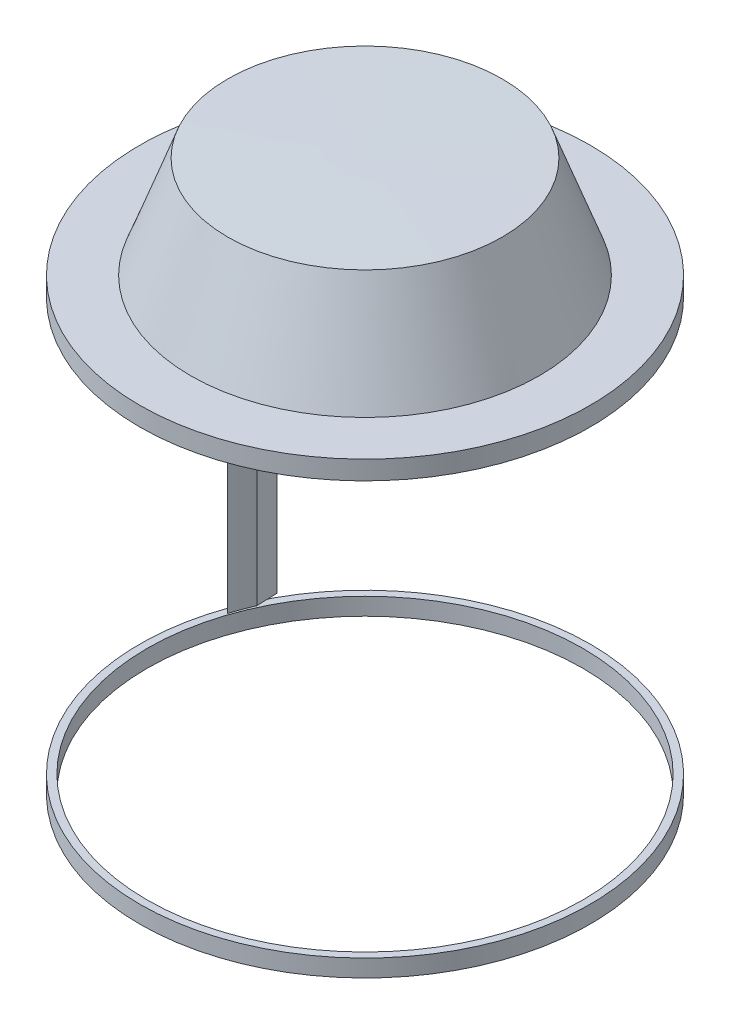
ISO-10303-21;
HEADER;
FILE_DESCRIPTION(('STEP AP214'),'2;1');
FILE_NAME('part.step','',(''),(''),'','','');
FILE_SCHEMA(('AUTOMOTIVE_DESIGN { 1 0 10303 214 1 1 1 1 }'));
ENDSEC;
DATA;
#1=APPLICATION_CONTEXT('core data for automotive mechanical design processes');
#2=APPLICATION_PROTOCOL_DEFINITION('international standard','automotive_design',2000,#1);
#3=PRODUCT_CONTEXT('',#1,'mechanical');
#4=PRODUCT('Part','Part','',(#3));
#5=PRODUCT_RELATED_PRODUCT_CATEGORY('part','',(#4));
#6=PRODUCT_DEFINITION_FORMATION('','',#4);
#7=PRODUCT_DEFINITION_CONTEXT('part definition',#1,'design');
#8=PRODUCT_DEFINITION('design','',#6,#7);
#9=PRODUCT_DEFINITION_SHAPE('','',#8);
#10=(LENGTH_UNIT() NAMED_UNIT(*) SI_UNIT(.MILLI.,.METRE.));
#11=(NAMED_UNIT(*) PLANE_ANGLE_UNIT() SI_UNIT($,.RADIAN.));
#12=(NAMED_UNIT(*) SI_UNIT($,.STERADIAN.) SOLID_ANGLE_UNIT());
#13=UNCERTAINTY_MEASURE_WITH_UNIT(LENGTH_MEASURE(1.E-05),#10,'distance_accuracy_value','');
#14=(GEOMETRIC_REPRESENTATION_CONTEXT(3) GLOBAL_UNCERTAINTY_ASSIGNED_CONTEXT((#13)) GLOBAL_UNIT_ASSIGNED_CONTEXT((#10,
#11,#12)) REPRESENTATION_CONTEXT('',''));
#15=CARTESIAN_POINT('',(0.,0.,0.));
#16=DIRECTION('',(0.,0.,1.));
#17=DIRECTION('',(1.,0.,0.));
#18=AXIS2_PLACEMENT_3D('',#15,#16,#17);
#19=CARTESIAN_POINT('',(50.8214618660544,38.8006335245978,0.));
#20=DIRECTION('',(0.,-1.,0.));
#21=DIRECTION('',(0.,0.,-1.));
#22=AXIS2_PLACEMENT_3D('',#19,#20,#21);
#23=PLANE('',#22);
#24=CARTESIAN_POINT('',(0.,38.8006335245978,0.));
#25=DIRECTION('',(0.,1.,0.));
#26=DIRECTION('',(0.,0.,1.));
#27=AXIS2_PLACEMENT_3D('',#24,#25,#26);
#28=CIRCLE('',#27,39.3096573372102);
#29=CARTESIAN_POINT('',(0.,38.8006335245978,39.3096573372102));
#30=VERTEX_POINT('',#29);
#31=EDGE_CURVE('E53',#30,#30,#28,.T.);
#32=ORIENTED_EDGE('',*,*,#31,.F.);
#33=EDGE_LOOP('',(#32));
#34=FACE_BOUND('',#33,.T.);
#35=CARTESIAN_POINT('',(0.,38.8006335245978,0.));
#36=DIRECTION('',(0.,1.,0.));
#37=DIRECTION('',(0.,0.,1.));
#38=AXIS2_PLACEMENT_3D('',#35,#36,#37);
#39=CIRCLE('',#38,50.8214618660544);
#40=CARTESIAN_POINT('',(0.,38.8006335245978,50.8214618660544));
#41=VERTEX_POINT('',#40);
#42=EDGE_CURVE('E86',#41,#41,#39,.T.);
#43=ORIENTED_EDGE('',*,*,#42,.T.);
#44=EDGE_LOOP('',(#43));
#45=FACE_BOUND('',#44,.T.);
#46=ADVANCED_FACE('F46',(#34,#45),#23,.F.);
#47=CARTESIAN_POINT('',(46.9224710295217,34.547188975653,0.));
#48=DIRECTION('',(0.,1.,0.));
#49=DIRECTION('',(0.,0.,1.));
#50=AXIS2_PLACEMENT_3D('',#47,#48,#49);
#51=PLANE('',#50);
#52=CARTESIAN_POINT('',(0.,34.547188975653,0.));
#53=DIRECTION('',(0.,1.,0.));
#54=DIRECTION('',(0.,0.,1.));
#55=AXIS2_PLACEMENT_3D('',#52,#53,#54);
#56=CIRCLE('',#55,49.1542674276819);
#57=CARTESIAN_POINT('',(0.,34.547188975653,49.1542674276819));
#58=VERTEX_POINT('',#57);
#59=EDGE_CURVE('E87',#58,#58,#56,.T.);
#60=ORIENTED_EDGE('',*,*,#59,.T.);
#61=EDGE_LOOP('',(#60));
#62=FACE_BOUND('',#61,.T.);
#63=CARTESIAN_POINT('',(0.,34.547188975653,0.));
#64=DIRECTION('',(0.,1.,0.));
#65=DIRECTION('',(0.,0.,1.));
#66=AXIS2_PLACEMENT_3D('',#63,#64,#65);
#67=CIRCLE('',#66,50.8214618660544);
#68=CARTESIAN_POINT('',(0.,34.547188975653,50.8214618660544));
#69=VERTEX_POINT('',#68);
#70=EDGE_CURVE('E90',#69,#69,#67,.T.);
#71=ORIENTED_EDGE('',*,*,#70,.F.);
#72=EDGE_LOOP('',(#71));
#73=FACE_BOUND('',#72,.T.);
#74=ADVANCED_FACE('F69',(#62,#73),#51,.F.);
#75=CARTESIAN_POINT('',(0.,38.8006335245978,0.));
#76=DIRECTION('',(0.,1.,0.));
#77=DIRECTION('',(0.,0.,1.));
#78=AXIS2_PLACEMENT_3D('',#75,#76,#77);
#79=CYLINDRICAL_SURFACE('',#78,50.8214618660544);
#80=ORIENTED_EDGE('',*,*,#42,.F.);
#81=EDGE_LOOP('',(#80));
#82=FACE_BOUND('',#81,.T.);
#83=ORIENTED_EDGE('',*,*,#70,.T.);
#84=EDGE_LOOP('',(#83));
#85=FACE_BOUND('',#84,.T.);
#86=ADVANCED_FACE('F59',(#82,#85),#79,.T.);
#87=CARTESIAN_POINT('',(0.,61.9732628137815,0.));
#88=DIRECTION('',(0.,-1.,0.));
#89=DIRECTION('',(0.,0.,-1.));
#90=AXIS2_PLACEMENT_3D('',#87,#88,#89);
#91=CONICAL_SURFACE('',#90,0.,1.56220719829463);
#92=CARTESIAN_POINT('',(0.,61.7075018877193,0.));
#93=DIRECTION('',(0.,1.,0.));
#94=DIRECTION('',(0.,0.,1.));
#95=AXIS2_PLACEMENT_3D('',#92,#93,#94);
#96=CIRCLE('',#95,30.9407864469088);
#97=CARTESIAN_POINT('',(0.,61.7075018877193,30.9407864469088));
#98=VERTEX_POINT('',#97);
#99=EDGE_CURVE('E94',#98,#98,#96,.T.);
#100=ORIENTED_EDGE('',*,*,#99,.T.);
#101=EDGE_LOOP('',(#100));
#102=FACE_BOUND('',#101,.T.);
#103=CARTESIAN_POINT('',(0.,61.9732628137815,0.));
#104=VERTEX_POINT('',#103);
#105=VERTEX_LOOP('',#104);
#106=FACE_BOUND('',#105,.T.);
#107=ADVANCED_FACE('F56',(#102,#106),#91,.T.);
#108=CARTESIAN_POINT('',(0.,61.7075018877193,0.));
#109=DIRECTION('',(0.,-1.,0.));
#110=DIRECTION('',(0.,0.,-1.));
#111=AXIS2_PLACEMENT_3D('',#108,#109,#110);
#112=CONICAL_SURFACE('',#111,30.9407864469088,0.350277762928811);
#113=ORIENTED_EDGE('',*,*,#31,.T.);
#114=EDGE_LOOP('',(#113));
#115=FACE_BOUND('',#114,.T.);
#116=ORIENTED_EDGE('',*,*,#99,.F.);
#117=EDGE_LOOP('',(#116));
#118=FACE_BOUND('',#117,.T.);
#119=ADVANCED_FACE('F58',(#115,#118),#112,.T.);
#120=CARTESIAN_POINT('',(0.,35.4268717747467,0.));
#121=DIRECTION('',(0.,-1.,0.));
#122=DIRECTION('',(0.,0.,-1.));
#123=AXIS2_PLACEMENT_3D('',#120,#121,#122);
#124=PLANE('',#123);
#125=CARTESIAN_POINT('',(0.,35.4268717747467,0.));
#126=DIRECTION('',(0.,-1.,0.));
#127=DIRECTION('',(0.,0.,-1.));
#128=AXIS2_PLACEMENT_3D('',#125,#126,#127);
#129=CIRCLE('',#128,49.1542674276819);
#130=CARTESIAN_POINT('',(0.,35.4268717747467,-49.1542674276819));
#131=VERTEX_POINT('',#130);
#132=EDGE_CURVE('E12',#131,#131,#129,.T.);
#133=ORIENTED_EDGE('',*,*,#132,.T.);
#134=EDGE_LOOP('',(#133));
#135=FACE_BOUND('',#134,.T.);
#136=ADVANCED_FACE('F66',(#135),#124,.T.);
#137=CARTESIAN_POINT('',(0.,35.4268717747467,0.));
#138=DIRECTION('',(0.,-1.,0.));
#139=DIRECTION('',(0.,0.,-1.));
#140=AXIS2_PLACEMENT_3D('',#137,#138,#139);
#141=CYLINDRICAL_SURFACE('',#140,49.1542674276819);
#142=ORIENTED_EDGE('',*,*,#132,.F.);
#143=EDGE_LOOP('',(#142));
#144=FACE_BOUND('',#143,.T.);
#145=ORIENTED_EDGE('',*,*,#59,.F.);
#146=EDGE_LOOP('',(#145));
#147=FACE_BOUND('',#146,.T.);
#148=ADVANCED_FACE('F48',(#144,#147),#141,.F.);
#149=CLOSED_SHELL('',(#46,#74,#86,#107,#119,#136,#148));
#150=MANIFOLD_SOLID_BREP('B2',#149);
#151=CARTESIAN_POINT('',(0.,0.,-25.));
#152=DIRECTION('',(0.,0.,1.));
#153=DIRECTION('',(1.,0.,0.));
#154=AXIS2_PLACEMENT_3D('',#151,#152,#153);
#155=PLANE('',#154);
#156=DIRECTION('',(0.,-1.,0.));
#157=VECTOR('',#156,1.);
#158=CARTESIAN_POINT('',(-46.4604895548918,0.,-25.));
#159=LINE('',#158,#157);
#160=CARTESIAN_POINT('',(-46.4604895548918,34.0899547844391,-25.));
#161=VERTEX_POINT('',#160);
#162=CARTESIAN_POINT('',(-46.4604895548918,-58.2377607655151,-25.));
#163=VERTEX_POINT('',#162);
#164=EDGE_CURVE('E222',#161,#163,#159,.T.);
#165=ORIENTED_EDGE('',*,*,#164,.F.);
#166=DIRECTION('',(-1.,0.,0.));
#167=VECTOR('',#166,1.);
#168=CARTESIAN_POINT('',(0.,34.0899547844391,-25.));
#169=LINE('',#168,#167);
#170=CARTESIAN_POINT('',(-44.8332428013027,34.0899547844391,-25.));
#171=VERTEX_POINT('',#170);
#172=EDGE_CURVE('E232',#171,#161,#169,.T.);
#173=ORIENTED_EDGE('',*,*,#172,.F.);
#174=DIRECTION('',(0.,1.,0.));
#175=VECTOR('',#174,1.);
#176=CARTESIAN_POINT('',(-44.8332428013026,0.,-25.));
#177=LINE('',#176,#175);
#178=CARTESIAN_POINT('',(-44.8332428013026,-58.2377607655151,-25.));
#179=VERTEX_POINT('',#178);
#180=EDGE_CURVE('E239',#179,#171,#177,.T.);
#181=ORIENTED_EDGE('',*,*,#180,.F.);
#182=DIRECTION('',(1.,0.,0.));
#183=VECTOR('',#182,1.);
#184=CARTESIAN_POINT('',(0.,-58.2377607655151,-25.));
#185=LINE('',#184,#183);
#186=EDGE_CURVE('E231',#163,#179,#185,.T.);
#187=ORIENTED_EDGE('',*,*,#186,.F.);
#188=EDGE_LOOP('',(#165,#173,#181,#187));
#189=FACE_BOUND('',#188,.T.);
#190=ADVANCED_FACE('F172',(#189),#155,.F.);
#191=CARTESIAN_POINT('',(-46.8968661780972,34.5263314076446,0.));
#192=DIRECTION('',(0.,0.999847695156391,-0.0174524064372835));
#193=DIRECTION('',(0.,0.0174524064372835,0.999847695156391));
#194=AXIS2_PLACEMENT_3D('',#191,#192,#193);
#195=PLANE('',#194);
#196=CARTESIAN_POINT('',(0.,34.5263314076446,0.));
#197=DIRECTION('',(0.,0.999847695156391,-0.0174524064372835));
#198=DIRECTION('',(0.,-0.0174524064372835,-0.999847695156391));
#199=AXIS2_PLACEMENT_3D('',#196,#197,#198);
#200=ELLIPSE('',#199,49.1617550010889,49.1542674276819);
#201=CARTESIAN_POINT('',(-44.7517755916488,34.171421994093,-20.3327466847639));
#202=VERTEX_POINT('',#201);
#203=CARTESIAN_POINT('',(-46.6251984761427,34.2546637056901,-15.5638322212868));
#204=VERTEX_POINT('',#203);
#205=EDGE_CURVE('E207',#202,#204,#200,.T.);
#206=ORIENTED_EDGE('',*,*,#205,.F.);
#207=DIRECTION('',(0.0174497491606827,0.0174497491606827,0.999695459881887));
#208=VECTOR('',#207,1.);
#209=CARTESIAN_POINT('',(-44.3968661780972,34.5263314076446,0.));
#210=LINE('',#209,#208);
#211=EDGE_CURVE('E225',#171,#202,#210,.T.);
#212=ORIENTED_EDGE('',*,*,#211,.F.);
#213=ORIENTED_EDGE('',*,*,#172,.T.);
#214=DIRECTION('',(-0.0174497491606827,0.0174497491606827,0.999695459881887));
#215=VECTOR('',#214,1.);
#216=CARTESIAN_POINT('',(-46.8968661780972,34.5263314076446,0.));
#217=LINE('',#216,#215);
#218=EDGE_CURVE('E230',#161,#204,#217,.T.);
#219=ORIENTED_EDGE('',*,*,#218,.T.);
#220=EDGE_LOOP('',(#206,#212,#213,#219));
#221=FACE_BOUND('',#220,.T.);
#222=ADVANCED_FACE('F247',(#221),#195,.T.);
#223=CARTESIAN_POINT('',(-46.8968661780972,-58.6741373887206,0.));
#224=DIRECTION('',(0.,-0.999847695156391,-0.0174524064372835));
#225=DIRECTION('',(0.,0.0174524064372835,-0.999847695156391));
#226=AXIS2_PLACEMENT_3D('',#223,#224,#225);
#227=PLANE('',#226);
#228=CARTESIAN_POINT('',(0.,-58.6741373887206,0.));
#229=DIRECTION('',(0.,-0.999847695156391,-0.0174524064372835));
#230=DIRECTION('',(0.,-0.0174524064372835,0.999847695156391));
#231=AXIS2_PLACEMENT_3D('',#228,#229,#230);
#232=ELLIPSE('',#231,49.1617550010889,49.1542674276819);
#233=CARTESIAN_POINT('',(-46.6251984761427,-58.4024696867661,-15.5638322212868));
#234=VERTEX_POINT('',#233);
#235=CARTESIAN_POINT('',(-44.7517755916488,-58.319227975169,-20.332746684764));
#236=VERTEX_POINT('',#235);
#237=EDGE_CURVE('E181',#234,#236,#232,.T.);
#238=ORIENTED_EDGE('',*,*,#237,.F.);
#239=DIRECTION('',(-0.0174497491606827,-0.0174497491606827,0.999695459881887));
#240=VECTOR('',#239,1.);
#241=CARTESIAN_POINT('',(-46.8684872182458,-58.6457584288692,-1.62582952100727));
#242=LINE('',#241,#240);
#243=EDGE_CURVE('E215',#163,#234,#242,.T.);
#244=ORIENTED_EDGE('',*,*,#243,.F.);
#245=ORIENTED_EDGE('',*,*,#186,.T.);
#246=DIRECTION('',(0.0174497491606827,-0.0174497491606827,0.999695459881887));
#247=VECTOR('',#246,1.);
#248=CARTESIAN_POINT('',(-44.3976274124616,-58.6733761543562,-0.0436110875300308));
#249=LINE('',#248,#247);
#250=EDGE_CURVE('E217',#179,#236,#249,.T.);
#251=ORIENTED_EDGE('',*,*,#250,.T.);
#252=EDGE_LOOP('',(#238,#244,#245,#251));
#253=FACE_BOUND('',#252,.T.);
#254=ADVANCED_FACE('F213',(#253),#227,.T.);
#255=CARTESIAN_POINT('',(-44.3968661780972,34.5263314076446,0.));
#256=DIRECTION('',(0.999847695156391,0.,-0.0174524064372835));
#257=DIRECTION('',(-0.0174524064372835,0.,-0.999847695156391));
#258=AXIS2_PLACEMENT_3D('',#255,#256,#257);
#259=PLANE('',#258);
#260=DIRECTION('',(0.,-1.,0.));
#261=VECTOR('',#260,1.);
#262=CARTESIAN_POINT('',(-44.7517755916488,35.4268717747467,-20.3327466847639));
#263=LINE('',#262,#261);
#264=EDGE_CURVE('E44',#236,#202,#263,.F.);
#265=ORIENTED_EDGE('',*,*,#264,.F.);
#266=ORIENTED_EDGE('',*,*,#250,.F.);
#267=ORIENTED_EDGE('',*,*,#180,.T.);
#268=ORIENTED_EDGE('',*,*,#211,.T.);
#269=EDGE_LOOP('',(#265,#266,#267,#268));
#270=FACE_BOUND('',#269,.T.);
#271=ADVANCED_FACE('F244',(#270),#259,.T.);
#272=CARTESIAN_POINT('',(-46.8968661780972,34.5263314076446,0.));
#273=DIRECTION('',(-0.999847695156391,0.,-0.0174524064372835));
#274=DIRECTION('',(-0.0174524064372835,0.,0.999847695156391));
#275=AXIS2_PLACEMENT_3D('',#272,#273,#274);
#276=PLANE('',#275);
#277=DIRECTION('',(0.,-1.,0.));
#278=VECTOR('',#277,1.);
#279=CARTESIAN_POINT('',(-46.6251984761427,35.4268717747467,-15.5638322212868));
#280=LINE('',#279,#278);
#281=EDGE_CURVE('E205',#204,#234,#280,.T.);
#282=ORIENTED_EDGE('',*,*,#281,.F.);
#283=ORIENTED_EDGE('',*,*,#218,.F.);
#284=ORIENTED_EDGE('',*,*,#164,.T.);
#285=ORIENTED_EDGE('',*,*,#243,.T.);
#286=EDGE_LOOP('',(#282,#283,#284,#285));
#287=FACE_BOUND('',#286,.T.);
#288=ADVANCED_FACE('F220',(#287),#276,.T.);
#289=CARTESIAN_POINT('',(0.,35.4268717747467,0.));
#290=DIRECTION('',(0.,-1.,0.));
#291=DIRECTION('',(0.,0.,-1.));
#292=AXIS2_PLACEMENT_3D('',#289,#290,#291);
#293=CYLINDRICAL_SURFACE('',#292,49.1542674276819);
#294=ORIENTED_EDGE('',*,*,#205,.T.);
#295=ORIENTED_EDGE('',*,*,#281,.T.);
#296=ORIENTED_EDGE('',*,*,#237,.T.);
#297=ORIENTED_EDGE('',*,*,#264,.T.);
#298=EDGE_LOOP('',(#294,#295,#296,#297));
#299=FACE_BOUND('',#298,.T.);
#300=ADVANCED_FACE('F174',(#299),#293,.F.);
#301=CLOSED_SHELL('',(#190,#222,#254,#271,#288,#300));
#302=MANIFOLD_SOLID_BREP('B6',#301);
#303=CARTESIAN_POINT('',(0.,-62.5731282252533,0.));
#304=DIRECTION('',(0.,1.,0.));
#305=DIRECTION('',(0.,0.,1.));
#306=AXIS2_PLACEMENT_3D('',#303,#304,#305);
#307=PLANE('',#306);
#308=CARTESIAN_POINT('',(0.,-62.5731282252533,0.));
#309=DIRECTION('',(0.,-1.,0.));
#310=DIRECTION('',(0.,0.,-1.));
#311=AXIS2_PLACEMENT_3D('',#308,#309,#310);
#312=CIRCLE('',#311,49.1542674276819);
#313=CARTESIAN_POINT('',(0.,-62.5731282252533,-49.1542674276819));
#314=VERTEX_POINT('',#313);
#315=EDGE_CURVE('E328',#314,#314,#312,.T.);
#316=ORIENTED_EDGE('',*,*,#315,.F.);
#317=EDGE_LOOP('',(#316));
#318=FACE_BOUND('',#317,.T.);
#319=CARTESIAN_POINT('',(0.,-62.5731282252533,0.));
#320=DIRECTION('',(0.,1.,0.));
#321=DIRECTION('',(0.,0.,1.));
#322=AXIS2_PLACEMENT_3D('',#319,#320,#321);
#323=CIRCLE('',#322,50.8214618660544);
#324=CARTESIAN_POINT('',(0.,-62.5731282252533,50.8214618660544));
#325=VERTEX_POINT('',#324);
#326=EDGE_CURVE('E171',#325,#325,#323,.T.);
#327=ORIENTED_EDGE('',*,*,#326,.F.);
#328=EDGE_LOOP('',(#327));
#329=FACE_BOUND('',#328,.T.);
#330=ADVANCED_FACE('F314',(#318,#329),#307,.F.);
#331=CARTESIAN_POINT('',(0.,38.8006335245978,0.));
#332=DIRECTION('',(0.,1.,0.));
#333=DIRECTION('',(0.,0.,1.));
#334=AXIS2_PLACEMENT_3D('',#331,#332,#333);
#335=CYLINDRICAL_SURFACE('',#334,50.8214618660544);
#336=CARTESIAN_POINT('',(0.,-58.6741373887206,0.));
#337=DIRECTION('',(0.,1.,0.));
#338=DIRECTION('',(0.,0.,1.));
#339=AXIS2_PLACEMENT_3D('',#336,#337,#338);
#340=CIRCLE('',#339,50.8214618660544);
#341=CARTESIAN_POINT('',(0.,-58.6741373887206,50.8214618660544));
#342=VERTEX_POINT('',#341);
#343=EDGE_CURVE('E320',#342,#342,#340,.T.);
#344=ORIENTED_EDGE('',*,*,#343,.F.);
#345=EDGE_LOOP('',(#344));
#346=FACE_BOUND('',#345,.T.);
#347=ORIENTED_EDGE('',*,*,#326,.T.);
#348=EDGE_LOOP('',(#347));
#349=FACE_BOUND('',#348,.T.);
#350=ADVANCED_FACE('F339',(#346,#349),#335,.T.);
#351=CARTESIAN_POINT('',(50.8214618660544,-58.6741373887206,0.));
#352=DIRECTION('',(0.,-1.,0.));
#353=DIRECTION('',(0.,0.,-1.));
#354=AXIS2_PLACEMENT_3D('',#351,#352,#353);
#355=PLANE('',#354);
#356=CARTESIAN_POINT('',(0.,-58.6741373887206,0.));
#357=DIRECTION('',(0.,-1.,0.));
#358=DIRECTION('',(0.,0.,-1.));
#359=AXIS2_PLACEMENT_3D('',#356,#357,#358);
#360=CIRCLE('',#359,49.1542674276819);
#361=CARTESIAN_POINT('',(0.,-58.6741373887206,-49.1542674276819));
#362=VERTEX_POINT('',#361);
#363=EDGE_CURVE('E324',#362,#362,#360,.T.);
#364=ORIENTED_EDGE('',*,*,#363,.T.);
#365=EDGE_LOOP('',(#364));
#366=FACE_BOUND('',#365,.T.);
#367=ORIENTED_EDGE('',*,*,#343,.T.);
#368=EDGE_LOOP('',(#367));
#369=FACE_BOUND('',#368,.T.);
#370=ADVANCED_FACE('F343',(#366,#369),#355,.F.);
#371=CARTESIAN_POINT('',(0.,35.4268717747467,0.));
#372=DIRECTION('',(0.,-1.,0.));
#373=DIRECTION('',(0.,0.,-1.));
#374=AXIS2_PLACEMENT_3D('',#371,#372,#373);
#375=CYLINDRICAL_SURFACE('',#374,49.1542674276819);
#376=ORIENTED_EDGE('',*,*,#315,.T.);
#377=EDGE_LOOP('',(#376));
#378=FACE_BOUND('',#377,.T.);
#379=ORIENTED_EDGE('',*,*,#363,.F.);
#380=EDGE_LOOP('',(#379));
#381=FACE_BOUND('',#380,.T.);
#382=ADVANCED_FACE('F334',(#378,#381),#375,.F.);
#383=CLOSED_SHELL('',(#330,#350,#370,#382));
#384=MANIFOLD_SOLID_BREP('B38',#383);
#385=ADVANCED_BREP_SHAPE_REPRESENTATION('',(#18,#150,#302,#384),#14);
#386=SHAPE_DEFINITION_REPRESENTATION(#9,#385);
ENDSEC;
END-ISO-10303-21;
